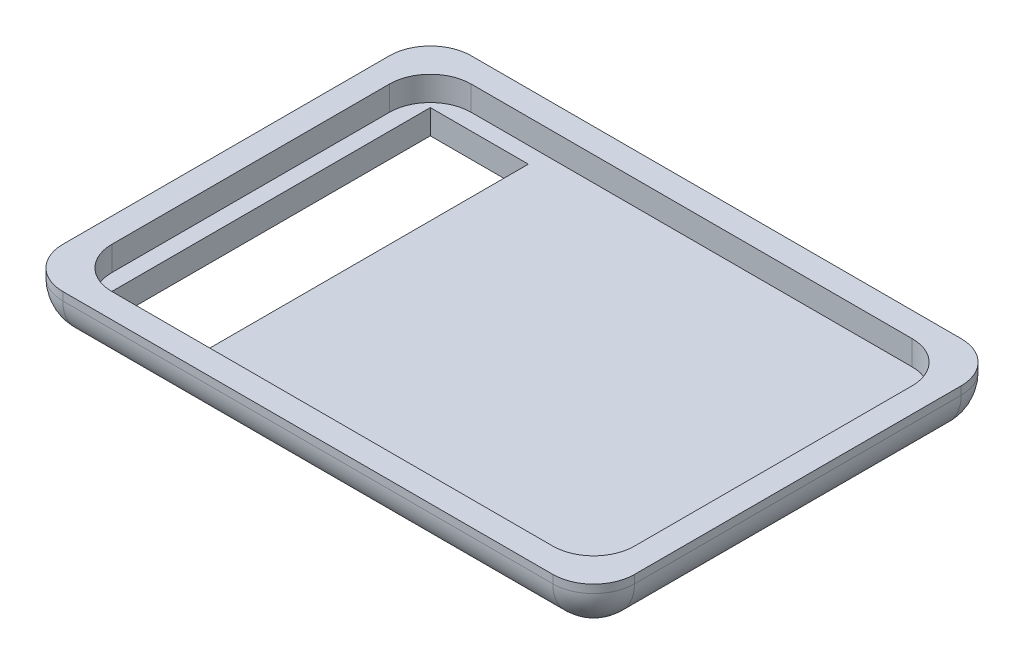
ISO-10303-21;
HEADER;
FILE_DESCRIPTION(('STEP AP214'),'2;1');
FILE_NAME('part.step','',(''),(''),'','','');
FILE_SCHEMA(('AUTOMOTIVE_DESIGN { 1 0 10303 214 1 1 1 1 }'));
ENDSEC;
DATA;
#1=APPLICATION_CONTEXT('core data for automotive mechanical design processes');
#2=APPLICATION_PROTOCOL_DEFINITION('international standard','automotive_design',2000,#1);
#3=PRODUCT_CONTEXT('',#1,'mechanical');
#4=PRODUCT('Part','Part','',(#3));
#5=PRODUCT_RELATED_PRODUCT_CATEGORY('part','',(#4));
#6=PRODUCT_DEFINITION_FORMATION('','',#4);
#7=PRODUCT_DEFINITION_CONTEXT('part definition',#1,'design');
#8=PRODUCT_DEFINITION('design','',#6,#7);
#9=PRODUCT_DEFINITION_SHAPE('','',#8);
#10=(LENGTH_UNIT() NAMED_UNIT(*) SI_UNIT(.MILLI.,.METRE.));
#11=(NAMED_UNIT(*) PLANE_ANGLE_UNIT() SI_UNIT($,.RADIAN.));
#12=(NAMED_UNIT(*) SI_UNIT($,.STERADIAN.) SOLID_ANGLE_UNIT());
#13=UNCERTAINTY_MEASURE_WITH_UNIT(LENGTH_MEASURE(1.E-05),#10,'distance_accuracy_value','');
#14=(GEOMETRIC_REPRESENTATION_CONTEXT(3) GLOBAL_UNCERTAINTY_ASSIGNED_CONTEXT((#13)) GLOBAL_UNIT_ASSIGNED_CONTEXT((#10,
#11,#12)) REPRESENTATION_CONTEXT('',''));
#15=CARTESIAN_POINT('',(0.,0.,0.));
#16=DIRECTION('',(0.,0.,1.));
#17=DIRECTION('',(1.,0.,0.));
#18=AXIS2_PLACEMENT_3D('',#15,#16,#17);
#19=CARTESIAN_POINT('',(0.,0.,0.));
#20=DIRECTION('',(0.,1.,0.));
#21=DIRECTION('',(0.,0.,1.));
#22=AXIS2_PLACEMENT_3D('',#19,#20,#21);
#23=PLANE('',#22);
#24=DIRECTION('',(0.,0.,1.));
#25=VECTOR('',#24,1.);
#26=CARTESIAN_POINT('',(-18.,0.,0.));
#27=LINE('',#26,#25);
#28=CARTESIAN_POINT('',(-18.,0.,-20.));
#29=VERTEX_POINT('',#28);
#30=CARTESIAN_POINT('',(-18.,0.,20.));
#31=VERTEX_POINT('',#30);
#32=EDGE_CURVE('E415',#29,#31,#27,.T.);
#33=ORIENTED_EDGE('',*,*,#32,.F.);
#34=DIRECTION('',(1.,0.,0.));
#35=VECTOR('',#34,1.);
#36=CARTESIAN_POINT('',(0.,0.,-20.));
#37=LINE('',#36,#35);
#38=CARTESIAN_POINT('',(30.,0.,-20.));
#39=VERTEX_POINT('',#38);
#40=EDGE_CURVE('E332',#29,#39,#37,.T.);
#41=ORIENTED_EDGE('',*,*,#40,.T.);
#42=DIRECTION('',(0.,0.,1.));
#43=VECTOR('',#42,1.);
#44=CARTESIAN_POINT('',(30.,0.,0.));
#45=LINE('',#44,#43);
#46=CARTESIAN_POINT('',(30.,0.,20.));
#47=VERTEX_POINT('',#46);
#48=EDGE_CURVE('E319',#39,#47,#45,.T.);
#49=ORIENTED_EDGE('',*,*,#48,.T.);
#50=DIRECTION('',(-1.,0.,0.));
#51=VECTOR('',#50,1.);
#52=CARTESIAN_POINT('',(0.,0.,20.));
#53=LINE('',#52,#51);
#54=EDGE_CURVE('E323',#47,#31,#53,.T.);
#55=ORIENTED_EDGE('',*,*,#54,.T.);
#56=EDGE_LOOP('',(#33,#41,#49,#55));
#57=FACE_BOUND('',#56,.T.);
#58=ADVANCED_FACE('F39',(#57),#23,.F.);
#59=CARTESIAN_POINT('',(0.,3.,0.));
#60=DIRECTION('',(0.,1.,0.));
#61=DIRECTION('',(0.,0.,1.));
#62=AXIS2_PLACEMENT_3D('',#59,#60,#61);
#63=PLANE('',#62);
#64=DIRECTION('',(0.,0.,-1.));
#65=VECTOR('',#64,1.);
#66=CARTESIAN_POINT('',(32.,3.,-25.));
#67=LINE('',#66,#65);
#68=CARTESIAN_POINT('',(32.,3.,17.));
#69=VERTEX_POINT('',#68);
#70=CARTESIAN_POINT('',(32.,3.,-17.));
#71=VERTEX_POINT('',#70);
#72=EDGE_CURVE('E411',#69,#71,#67,.T.);
#73=ORIENTED_EDGE('',*,*,#72,.T.);
#74=CARTESIAN_POINT('',(27.,3.,-17.));
#75=DIRECTION('',(0.,1.,0.));
#76=DIRECTION('',(0.,0.,1.));
#77=AXIS2_PLACEMENT_3D('',#74,#75,#76);
#78=CIRCLE('',#77,5.);
#79=CARTESIAN_POINT('',(27.,3.,-22.));
#80=VERTEX_POINT('',#79);
#81=EDGE_CURVE('E210',#71,#80,#78,.T.);
#82=ORIENTED_EDGE('',*,*,#81,.T.);
#83=DIRECTION('',(-1.,0.,0.));
#84=VECTOR('',#83,1.);
#85=CARTESIAN_POINT('',(-35.,3.,-22.));
#86=LINE('',#85,#84);
#87=CARTESIAN_POINT('',(-27.,3.,-22.));
#88=VERTEX_POINT('',#87);
#89=EDGE_CURVE('E408',#80,#88,#86,.T.);
#90=ORIENTED_EDGE('',*,*,#89,.T.);
#91=CARTESIAN_POINT('',(-27.,3.,-17.));
#92=DIRECTION('',(0.,1.,0.));
#93=DIRECTION('',(0.,0.,1.));
#94=AXIS2_PLACEMENT_3D('',#91,#92,#93);
#95=CIRCLE('',#94,5.);
#96=CARTESIAN_POINT('',(-32.,3.,-17.));
#97=VERTEX_POINT('',#96);
#98=EDGE_CURVE('E224',#88,#97,#95,.T.);
#99=ORIENTED_EDGE('',*,*,#98,.T.);
#100=DIRECTION('',(0.,0.,1.));
#101=VECTOR('',#100,1.);
#102=CARTESIAN_POINT('',(-32.,3.,-25.));
#103=LINE('',#102,#101);
#104=CARTESIAN_POINT('',(-32.,3.,17.));
#105=VERTEX_POINT('',#104);
#106=EDGE_CURVE('E405',#97,#105,#103,.T.);
#107=ORIENTED_EDGE('',*,*,#106,.T.);
#108=CARTESIAN_POINT('',(-27.,3.,17.));
#109=DIRECTION('',(0.,1.,0.));
#110=DIRECTION('',(0.,0.,1.));
#111=AXIS2_PLACEMENT_3D('',#108,#109,#110);
#112=CIRCLE('',#111,5.);
#113=CARTESIAN_POINT('',(-27.,3.,22.));
#114=VERTEX_POINT('',#113);
#115=EDGE_CURVE('E238',#105,#114,#112,.T.);
#116=ORIENTED_EDGE('',*,*,#115,.T.);
#117=DIRECTION('',(1.,0.,0.));
#118=VECTOR('',#117,1.);
#119=CARTESIAN_POINT('',(-35.,3.,22.));
#120=LINE('',#119,#118);
#121=CARTESIAN_POINT('',(27.,3.,22.));
#122=VERTEX_POINT('',#121);
#123=EDGE_CURVE('E402',#114,#122,#120,.T.);
#124=ORIENTED_EDGE('',*,*,#123,.T.);
#125=CARTESIAN_POINT('',(27.,3.,17.));
#126=DIRECTION('',(0.,1.,0.));
#127=DIRECTION('',(0.,0.,1.));
#128=AXIS2_PLACEMENT_3D('',#125,#126,#127);
#129=CIRCLE('',#128,5.);
#130=EDGE_CURVE('E252',#122,#69,#129,.T.);
#131=ORIENTED_EDGE('',*,*,#130,.T.);
#132=EDGE_LOOP('',(#73,#82,#90,#99,#107,#116,#124,#131));
#133=FACE_BOUND('',#132,.T.);
#134=DIRECTION('',(1.,0.,0.));
#135=VECTOR('',#134,1.);
#136=CARTESIAN_POINT('',(0.,3.,-20.));
#137=LINE('',#136,#135);
#138=CARTESIAN_POINT('',(-30.,3.,-20.));
#139=VERTEX_POINT('',#138);
#140=CARTESIAN_POINT('',(-18.,3.,-20.));
#141=VERTEX_POINT('',#140);
#142=EDGE_CURVE('E182',#139,#141,#137,.T.);
#143=ORIENTED_EDGE('',*,*,#142,.T.);
#144=DIRECTION('',(0.,0.,1.));
#145=VECTOR('',#144,1.);
#146=CARTESIAN_POINT('',(-18.,3.,0.));
#147=LINE('',#146,#145);
#148=CARTESIAN_POINT('',(-18.,3.,20.));
#149=VERTEX_POINT('',#148);
#150=EDGE_CURVE('E11',#141,#149,#147,.T.);
#151=ORIENTED_EDGE('',*,*,#150,.T.);
#152=DIRECTION('',(-1.,0.,0.));
#153=VECTOR('',#152,1.);
#154=CARTESIAN_POINT('',(0.,3.,20.));
#155=LINE('',#154,#153);
#156=CARTESIAN_POINT('',(-30.,3.,20.));
#157=VERTEX_POINT('',#156);
#158=EDGE_CURVE('E48',#149,#157,#155,.T.);
#159=ORIENTED_EDGE('',*,*,#158,.T.);
#160=DIRECTION('',(0.,0.,-1.));
#161=VECTOR('',#160,1.);
#162=CARTESIAN_POINT('',(-30.,3.,0.));
#163=LINE('',#162,#161);
#164=EDGE_CURVE('E190',#157,#139,#163,.T.);
#165=ORIENTED_EDGE('',*,*,#164,.T.);
#166=EDGE_LOOP('',(#143,#151,#159,#165));
#167=FACE_BOUND('',#166,.T.);
#168=ADVANCED_FACE('F203',(#133,#167),#63,.T.);
#169=CARTESIAN_POINT('',(27.,5.99999999999999,-17.));
#170=DIRECTION('',(0.,-1.,0.));
#171=DIRECTION('',(0.,0.,-1.));
#172=AXIS2_PLACEMENT_3D('',#169,#170,#171);
#173=CYLINDRICAL_SURFACE('',#172,5.);
#174=DIRECTION('',(0.,1.,0.));
#175=VECTOR('',#174,1.);
#176=CARTESIAN_POINT('',(27.,5.99999999999999,-22.));
#177=LINE('',#176,#175);
#178=CARTESIAN_POINT('',(27.,5.99999999999999,-22.));
#179=VERTEX_POINT('',#178);
#180=EDGE_CURVE('E217',#80,#179,#177,.T.);
#181=ORIENTED_EDGE('',*,*,#180,.F.);
#182=ORIENTED_EDGE('',*,*,#81,.F.);
#183=DIRECTION('',(0.,1.,0.));
#184=VECTOR('',#183,1.);
#185=CARTESIAN_POINT('',(32.,5.99999999999999,-17.));
#186=LINE('',#185,#184);
#187=CARTESIAN_POINT('',(32.,5.99999999999999,-17.));
#188=VERTEX_POINT('',#187);
#189=EDGE_CURVE('E213',#188,#71,#186,.F.);
#190=ORIENTED_EDGE('',*,*,#189,.F.);
#191=CARTESIAN_POINT('',(27.,5.99999999999999,-17.));
#192=DIRECTION('',(0.,1.,0.));
#193=DIRECTION('',(0.,0.,1.));
#194=AXIS2_PLACEMENT_3D('',#191,#192,#193);
#195=CIRCLE('',#194,5.);
#196=EDGE_CURVE('E63',#188,#179,#195,.T.);
#197=ORIENTED_EDGE('',*,*,#196,.T.);
#198=EDGE_LOOP('',(#181,#182,#190,#197));
#199=FACE_BOUND('',#198,.T.);
#200=ADVANCED_FACE('F41',(#199),#173,.F.);
#201=CARTESIAN_POINT('',(-27.,5.99999999999999,-17.));
#202=DIRECTION('',(0.,-1.,0.));
#203=DIRECTION('',(0.,0.,-1.));
#204=AXIS2_PLACEMENT_3D('',#201,#202,#203);
#205=CYLINDRICAL_SURFACE('',#204,5.);
#206=DIRECTION('',(0.,1.,0.));
#207=VECTOR('',#206,1.);
#208=CARTESIAN_POINT('',(-32.,5.99999999999999,-17.));
#209=LINE('',#208,#207);
#210=CARTESIAN_POINT('',(-32.,5.99999999999999,-17.));
#211=VERTEX_POINT('',#210);
#212=EDGE_CURVE('E231',#97,#211,#209,.T.);
#213=ORIENTED_EDGE('',*,*,#212,.F.);
#214=ORIENTED_EDGE('',*,*,#98,.F.);
#215=DIRECTION('',(0.,1.,0.));
#216=VECTOR('',#215,1.);
#217=CARTESIAN_POINT('',(-27.,5.99999999999999,-22.));
#218=LINE('',#217,#216);
#219=CARTESIAN_POINT('',(-27.,5.99999999999999,-22.));
#220=VERTEX_POINT('',#219);
#221=EDGE_CURVE('E227',#220,#88,#218,.F.);
#222=ORIENTED_EDGE('',*,*,#221,.F.);
#223=CARTESIAN_POINT('',(-27.,5.99999999999999,-17.));
#224=DIRECTION('',(0.,1.,0.));
#225=DIRECTION('',(0.,0.,1.));
#226=AXIS2_PLACEMENT_3D('',#223,#224,#225);
#227=CIRCLE('',#226,5.);
#228=EDGE_CURVE('E221',#220,#211,#227,.T.);
#229=ORIENTED_EDGE('',*,*,#228,.T.);
#230=EDGE_LOOP('',(#213,#214,#222,#229));
#231=FACE_BOUND('',#230,.T.);
#232=ADVANCED_FACE('F562',(#231),#205,.F.);
#233=CARTESIAN_POINT('',(-27.,5.99999999999999,17.));
#234=DIRECTION('',(0.,-1.,0.));
#235=DIRECTION('',(0.,0.,-1.));
#236=AXIS2_PLACEMENT_3D('',#233,#234,#235);
#237=CYLINDRICAL_SURFACE('',#236,5.);
#238=DIRECTION('',(0.,1.,0.));
#239=VECTOR('',#238,1.);
#240=CARTESIAN_POINT('',(-27.,5.99999999999999,22.));
#241=LINE('',#240,#239);
#242=CARTESIAN_POINT('',(-27.,5.99999999999999,22.));
#243=VERTEX_POINT('',#242);
#244=EDGE_CURVE('E245',#114,#243,#241,.T.);
#245=ORIENTED_EDGE('',*,*,#244,.F.);
#246=ORIENTED_EDGE('',*,*,#115,.F.);
#247=DIRECTION('',(0.,1.,0.));
#248=VECTOR('',#247,1.);
#249=CARTESIAN_POINT('',(-32.,5.99999999999999,17.));
#250=LINE('',#249,#248);
#251=CARTESIAN_POINT('',(-32.,5.99999999999999,17.));
#252=VERTEX_POINT('',#251);
#253=EDGE_CURVE('E241',#252,#105,#250,.F.);
#254=ORIENTED_EDGE('',*,*,#253,.F.);
#255=CARTESIAN_POINT('',(-27.,5.99999999999999,17.));
#256=DIRECTION('',(0.,1.,0.));
#257=DIRECTION('',(0.,0.,1.));
#258=AXIS2_PLACEMENT_3D('',#255,#256,#257);
#259=CIRCLE('',#258,5.);
#260=EDGE_CURVE('E235',#252,#243,#259,.T.);
#261=ORIENTED_EDGE('',*,*,#260,.T.);
#262=EDGE_LOOP('',(#245,#246,#254,#261));
#263=FACE_BOUND('',#262,.T.);
#264=ADVANCED_FACE('F559',(#263),#237,.F.);
#265=CARTESIAN_POINT('',(27.,5.99999999999999,17.));
#266=DIRECTION('',(0.,1.,0.));
#267=DIRECTION('',(0.,0.,1.));
#268=AXIS2_PLACEMENT_3D('',#265,#266,#267);
#269=CYLINDRICAL_SURFACE('',#268,5.);
#270=DIRECTION('',(0.,-1.,0.));
#271=VECTOR('',#270,1.);
#272=CARTESIAN_POINT('',(27.,5.99999999999999,22.));
#273=LINE('',#272,#271);
#274=CARTESIAN_POINT('',(27.,5.99999999999999,22.));
#275=VERTEX_POINT('',#274);
#276=EDGE_CURVE('E259',#275,#122,#273,.T.);
#277=ORIENTED_EDGE('',*,*,#276,.F.);
#278=CARTESIAN_POINT('',(27.,5.99999999999999,17.));
#279=DIRECTION('',(0.,1.,0.));
#280=DIRECTION('',(0.,0.,1.));
#281=AXIS2_PLACEMENT_3D('',#278,#279,#280);
#282=CIRCLE('',#281,5.);
#283=CARTESIAN_POINT('',(32.,5.99999999999999,17.));
#284=VERTEX_POINT('',#283);
#285=EDGE_CURVE('E249',#275,#284,#282,.T.);
#286=ORIENTED_EDGE('',*,*,#285,.T.);
#287=DIRECTION('',(0.,-1.,0.));
#288=VECTOR('',#287,1.);
#289=CARTESIAN_POINT('',(32.,5.99999999999999,17.));
#290=LINE('',#289,#288);
#291=EDGE_CURVE('E255',#69,#284,#290,.F.);
#292=ORIENTED_EDGE('',*,*,#291,.F.);
#293=ORIENTED_EDGE('',*,*,#130,.F.);
#294=EDGE_LOOP('',(#277,#286,#292,#293));
#295=FACE_BOUND('',#294,.T.);
#296=ADVANCED_FACE('F556',(#295),#269,.F.);
#297=CARTESIAN_POINT('',(30.,5.,-20.));
#298=DIRECTION('',(0.,1.,0.));
#299=DIRECTION('',(0.,0.,1.));
#300=AXIS2_PLACEMENT_3D('',#297,#298,#299);
#301=SPHERICAL_SURFACE('',#300,5.);
#302=CARTESIAN_POINT('',(30.,5.,-20.));
#303=DIRECTION('',(0.,0.,1.));
#304=DIRECTION('',(1.,0.,0.));
#305=AXIS2_PLACEMENT_3D('',#302,#303,#304);
#306=CIRCLE('',#305,5.);
#307=CARTESIAN_POINT('',(35.,5.,-20.));
#308=VERTEX_POINT('',#307);
#309=EDGE_CURVE('E263',#39,#308,#306,.T.);
#310=ORIENTED_EDGE('',*,*,#309,.F.);
#311=CARTESIAN_POINT('',(30.,5.,-20.));
#312=DIRECTION('',(1.,0.,0.));
#313=DIRECTION('',(0.,0.,-1.));
#314=AXIS2_PLACEMENT_3D('',#311,#312,#313);
#315=CIRCLE('',#314,5.);
#316=CARTESIAN_POINT('',(30.,5.,-25.));
#317=VERTEX_POINT('',#316);
#318=EDGE_CURVE('E266',#39,#317,#315,.T.);
#319=ORIENTED_EDGE('',*,*,#318,.T.);
#320=CARTESIAN_POINT('',(30.,5.,-20.));
#321=DIRECTION('',(0.,1.,0.));
#322=DIRECTION('',(0.,0.,1.));
#323=AXIS2_PLACEMENT_3D('',#320,#321,#322);
#324=CIRCLE('',#323,5.);
#325=EDGE_CURVE('E287',#308,#317,#324,.T.);
#326=ORIENTED_EDGE('',*,*,#325,.F.);
#327=EDGE_LOOP('',(#310,#319,#326));
#328=FACE_BOUND('',#327,.T.);
#329=ADVANCED_FACE('F440',(#328),#301,.T.);
#330=CARTESIAN_POINT('',(0.,5.,-20.));
#331=DIRECTION('',(1.,0.,0.));
#332=DIRECTION('',(0.,0.,-1.));
#333=AXIS2_PLACEMENT_3D('',#330,#331,#332);
#334=CYLINDRICAL_SURFACE('',#333,5.);
#335=ORIENTED_EDGE('',*,*,#318,.F.);
#336=ORIENTED_EDGE('',*,*,#40,.F.);
#337=CARTESIAN_POINT('',(-30.,0.,-20.));
#338=VERTEX_POINT('',#337);
#339=EDGE_CURVE('E329',#338,#29,#37,.T.);
#340=ORIENTED_EDGE('',*,*,#339,.F.);
#341=CARTESIAN_POINT('',(-30.,5.,-20.));
#342=DIRECTION('',(1.,0.,0.));
#343=DIRECTION('',(0.,0.,-1.));
#344=AXIS2_PLACEMENT_3D('',#341,#342,#343);
#345=CIRCLE('',#344,5.);
#346=CARTESIAN_POINT('',(-30.,5.,-25.));
#347=VERTEX_POINT('',#346);
#348=EDGE_CURVE('E269',#338,#347,#345,.T.);
#349=ORIENTED_EDGE('',*,*,#348,.T.);
#350=DIRECTION('',(1.,0.,0.));
#351=VECTOR('',#350,1.);
#352=CARTESIAN_POINT('',(-35.,5.,-25.));
#353=LINE('',#352,#351);
#354=EDGE_CURVE('E291',#317,#347,#353,.F.);
#355=ORIENTED_EDGE('',*,*,#354,.F.);
#356=EDGE_LOOP('',(#335,#336,#340,#349,#355));
#357=FACE_BOUND('',#356,.T.);
#358=ADVANCED_FACE('F444',(#357),#334,.T.);
#359=CARTESIAN_POINT('',(-30.,5.,-20.));
#360=DIRECTION('',(0.,1.,0.));
#361=DIRECTION('',(0.,0.,1.));
#362=AXIS2_PLACEMENT_3D('',#359,#360,#361);
#363=SPHERICAL_SURFACE('',#362,5.);
#364=ORIENTED_EDGE('',*,*,#348,.F.);
#365=CARTESIAN_POINT('',(-30.,5.,-20.));
#366=DIRECTION('',(0.,0.,-1.));
#367=DIRECTION('',(-1.,0.,0.));
#368=AXIS2_PLACEMENT_3D('',#365,#366,#367);
#369=CIRCLE('',#368,5.);
#370=CARTESIAN_POINT('',(-35.,5.,-20.));
#371=VERTEX_POINT('',#370);
#372=EDGE_CURVE('E272',#338,#371,#369,.T.);
#373=ORIENTED_EDGE('',*,*,#372,.T.);
#374=CARTESIAN_POINT('',(-30.,5.,-20.));
#375=DIRECTION('',(0.,-1.,0.));
#376=DIRECTION('',(0.,0.,-1.));
#377=AXIS2_PLACEMENT_3D('',#374,#375,#376);
#378=CIRCLE('',#377,5.);
#379=EDGE_CURVE('E295',#347,#371,#378,.F.);
#380=ORIENTED_EDGE('',*,*,#379,.F.);
#381=EDGE_LOOP('',(#364,#373,#380));
#382=FACE_BOUND('',#381,.T.);
#383=ADVANCED_FACE('F492',(#382),#363,.T.);
#384=CARTESIAN_POINT('',(-30.,5.,0.));
#385=DIRECTION('',(0.,0.,-1.));
#386=DIRECTION('',(-1.,0.,0.));
#387=AXIS2_PLACEMENT_3D('',#384,#385,#386);
#388=CYLINDRICAL_SURFACE('',#387,5.);
#389=ORIENTED_EDGE('',*,*,#372,.F.);
#390=DIRECTION('',(0.,0.,-1.));
#391=VECTOR('',#390,1.);
#392=CARTESIAN_POINT('',(-30.,0.,0.));
#393=LINE('',#392,#391);
#394=CARTESIAN_POINT('',(-30.,0.,20.));
#395=VERTEX_POINT('',#394);
#396=EDGE_CURVE('E197',#395,#338,#393,.T.);
#397=ORIENTED_EDGE('',*,*,#396,.F.);
#398=CARTESIAN_POINT('',(-30.,5.,20.));
#399=DIRECTION('',(0.,0.,-1.));
#400=DIRECTION('',(-1.,0.,0.));
#401=AXIS2_PLACEMENT_3D('',#398,#399,#400);
#402=CIRCLE('',#401,5.);
#403=CARTESIAN_POINT('',(-35.,5.,20.));
#404=VERTEX_POINT('',#403);
#405=EDGE_CURVE('E275',#395,#404,#402,.T.);
#406=ORIENTED_EDGE('',*,*,#405,.T.);
#407=DIRECTION('',(0.,0.,-1.));
#408=VECTOR('',#407,1.);
#409=CARTESIAN_POINT('',(-35.,5.,-25.));
#410=LINE('',#409,#408);
#411=EDGE_CURVE('E299',#371,#404,#410,.F.);
#412=ORIENTED_EDGE('',*,*,#411,.F.);
#413=EDGE_LOOP('',(#389,#397,#406,#412));
#414=FACE_BOUND('',#413,.T.);
#415=ADVANCED_FACE('F482',(#414),#388,.T.);
#416=CARTESIAN_POINT('',(-30.,5.,20.));
#417=DIRECTION('',(0.,1.,0.));
#418=DIRECTION('',(0.,0.,1.));
#419=AXIS2_PLACEMENT_3D('',#416,#417,#418);
#420=SPHERICAL_SURFACE('',#419,5.);
#421=ORIENTED_EDGE('',*,*,#405,.F.);
#422=CARTESIAN_POINT('',(-30.,5.,20.));
#423=DIRECTION('',(-1.,0.,0.));
#424=DIRECTION('',(0.,0.,1.));
#425=AXIS2_PLACEMENT_3D('',#422,#423,#424);
#426=CIRCLE('',#425,5.);
#427=CARTESIAN_POINT('',(-30.,5.,25.));
#428=VERTEX_POINT('',#427);
#429=EDGE_CURVE('E278',#395,#428,#426,.T.);
#430=ORIENTED_EDGE('',*,*,#429,.T.);
#431=CARTESIAN_POINT('',(-30.,5.,20.));
#432=DIRECTION('',(0.,-1.,0.));
#433=DIRECTION('',(0.,0.,-1.));
#434=AXIS2_PLACEMENT_3D('',#431,#432,#433);
#435=CIRCLE('',#434,5.);
#436=EDGE_CURVE('E303',#404,#428,#435,.F.);
#437=ORIENTED_EDGE('',*,*,#436,.F.);
#438=EDGE_LOOP('',(#421,#430,#437));
#439=FACE_BOUND('',#438,.T.);
#440=ADVANCED_FACE('F478',(#439),#420,.T.);
#441=CARTESIAN_POINT('',(0.,5.,20.));
#442=DIRECTION('',(-1.,0.,0.));
#443=DIRECTION('',(0.,0.,1.));
#444=AXIS2_PLACEMENT_3D('',#441,#442,#443);
#445=CYLINDRICAL_SURFACE('',#444,5.);
#446=ORIENTED_EDGE('',*,*,#429,.F.);
#447=DIRECTION('',(-1.,0.,0.));
#448=VECTOR('',#447,1.);
#449=CARTESIAN_POINT('',(0.,0.,20.));
#450=LINE('',#449,#448);
#451=EDGE_CURVE('E418',#31,#395,#450,.T.);
#452=ORIENTED_EDGE('',*,*,#451,.F.);
#453=ORIENTED_EDGE('',*,*,#54,.F.);
#454=CARTESIAN_POINT('',(30.,5.,20.));
#455=DIRECTION('',(-1.,0.,0.));
#456=DIRECTION('',(0.,0.,1.));
#457=AXIS2_PLACEMENT_3D('',#454,#455,#456);
#458=CIRCLE('',#457,5.);
#459=CARTESIAN_POINT('',(30.,5.,25.));
#460=VERTEX_POINT('',#459);
#461=EDGE_CURVE('E281',#47,#460,#458,.T.);
#462=ORIENTED_EDGE('',*,*,#461,.T.);
#463=DIRECTION('',(-1.,0.,0.));
#464=VECTOR('',#463,1.);
#465=CARTESIAN_POINT('',(-35.,5.,25.));
#466=LINE('',#465,#464);
#467=EDGE_CURVE('E307',#428,#460,#466,.F.);
#468=ORIENTED_EDGE('',*,*,#467,.F.);
#469=EDGE_LOOP('',(#446,#452,#453,#462,#468));
#470=FACE_BOUND('',#469,.T.);
#471=ADVANCED_FACE('F473',(#470),#445,.T.);
#472=CARTESIAN_POINT('',(30.,5.,20.));
#473=DIRECTION('',(0.,1.,0.));
#474=DIRECTION('',(0.,0.,1.));
#475=AXIS2_PLACEMENT_3D('',#472,#473,#474);
#476=SPHERICAL_SURFACE('',#475,5.);
#477=ORIENTED_EDGE('',*,*,#461,.F.);
#478=CARTESIAN_POINT('',(30.,5.,20.));
#479=DIRECTION('',(0.,0.,1.));
#480=DIRECTION('',(1.,0.,0.));
#481=AXIS2_PLACEMENT_3D('',#478,#479,#480);
#482=CIRCLE('',#481,5.);
#483=CARTESIAN_POINT('',(35.,5.,20.));
#484=VERTEX_POINT('',#483);
#485=EDGE_CURVE('E284',#47,#484,#482,.T.);
#486=ORIENTED_EDGE('',*,*,#485,.T.);
#487=CARTESIAN_POINT('',(30.,5.,20.));
#488=DIRECTION('',(0.,1.,0.));
#489=DIRECTION('',(0.,0.,1.));
#490=AXIS2_PLACEMENT_3D('',#487,#488,#489);
#491=CIRCLE('',#490,5.);
#492=EDGE_CURVE('E311',#460,#484,#491,.T.);
#493=ORIENTED_EDGE('',*,*,#492,.F.);
#494=EDGE_LOOP('',(#477,#486,#493));
#495=FACE_BOUND('',#494,.T.);
#496=ADVANCED_FACE('F449',(#495),#476,.T.);
#497=CARTESIAN_POINT('',(30.,5.,0.));
#498=DIRECTION('',(0.,0.,1.));
#499=DIRECTION('',(1.,0.,0.));
#500=AXIS2_PLACEMENT_3D('',#497,#498,#499);
#501=CYLINDRICAL_SURFACE('',#500,5.);
#502=ORIENTED_EDGE('',*,*,#48,.F.);
#503=ORIENTED_EDGE('',*,*,#309,.T.);
#504=DIRECTION('',(0.,0.,1.));
#505=VECTOR('',#504,1.);
#506=CARTESIAN_POINT('',(35.,5.,-25.));
#507=LINE('',#506,#505);
#508=EDGE_CURVE('E315',#484,#308,#507,.F.);
#509=ORIENTED_EDGE('',*,*,#508,.F.);
#510=ORIENTED_EDGE('',*,*,#485,.F.);
#511=EDGE_LOOP('',(#502,#503,#509,#510));
#512=FACE_BOUND('',#511,.T.);
#513=ADVANCED_FACE('F446',(#512),#501,.T.);
#514=CARTESIAN_POINT('',(-30.,5.99999999999999,-20.));
#515=DIRECTION('',(0.,-1.,0.));
#516=DIRECTION('',(0.,0.,-1.));
#517=AXIS2_PLACEMENT_3D('',#514,#515,#516);
#518=CYLINDRICAL_SURFACE('',#517,5.);
#519=DIRECTION('',(0.,-1.,0.));
#520=VECTOR('',#519,1.);
#521=CARTESIAN_POINT('',(-30.,5.99999999999999,-25.));
#522=LINE('',#521,#520);
#523=CARTESIAN_POINT('',(-30.,5.99999999999999,-25.));
#524=VERTEX_POINT('',#523);
#525=EDGE_CURVE('E336',#347,#524,#522,.F.);
#526=ORIENTED_EDGE('',*,*,#525,.F.);
#527=ORIENTED_EDGE('',*,*,#379,.T.);
#528=DIRECTION('',(0.,-1.,0.));
#529=VECTOR('',#528,1.);
#530=CARTESIAN_POINT('',(-35.,5.99999999999999,-20.));
#531=LINE('',#530,#529);
#532=CARTESIAN_POINT('',(-35.,5.99999999999999,-20.));
#533=VERTEX_POINT('',#532);
#534=EDGE_CURVE('E339',#533,#371,#531,.T.);
#535=ORIENTED_EDGE('',*,*,#534,.F.);
#536=CARTESIAN_POINT('',(-30.,5.99999999999999,-20.));
#537=DIRECTION('',(0.,1.,0.));
#538=DIRECTION('',(0.,0.,1.));
#539=AXIS2_PLACEMENT_3D('',#536,#537,#538);
#540=CIRCLE('',#539,5.);
#541=EDGE_CURVE('E333',#524,#533,#540,.T.);
#542=ORIENTED_EDGE('',*,*,#541,.F.);
#543=EDGE_LOOP('',(#526,#527,#535,#542));
#544=FACE_BOUND('',#543,.T.);
#545=ADVANCED_FACE('F489',(#544),#518,.T.);
#546=CARTESIAN_POINT('',(-30.,5.99999999999999,20.));
#547=DIRECTION('',(0.,-1.,0.));
#548=DIRECTION('',(0.,0.,-1.));
#549=AXIS2_PLACEMENT_3D('',#546,#547,#548);
#550=CYLINDRICAL_SURFACE('',#549,5.);
#551=DIRECTION('',(0.,-1.,0.));
#552=VECTOR('',#551,1.);
#553=CARTESIAN_POINT('',(-35.,5.99999999999999,20.));
#554=LINE('',#553,#552);
#555=CARTESIAN_POINT('',(-35.,5.99999999999999,20.));
#556=VERTEX_POINT('',#555);
#557=EDGE_CURVE('E346',#404,#556,#554,.F.);
#558=ORIENTED_EDGE('',*,*,#557,.F.);
#559=ORIENTED_EDGE('',*,*,#436,.T.);
#560=DIRECTION('',(0.,-1.,0.));
#561=VECTOR('',#560,1.);
#562=CARTESIAN_POINT('',(-30.,5.99999999999999,25.));
#563=LINE('',#562,#561);
#564=CARTESIAN_POINT('',(-30.,5.99999999999999,25.));
#565=VERTEX_POINT('',#564);
#566=EDGE_CURVE('E349',#565,#428,#563,.T.);
#567=ORIENTED_EDGE('',*,*,#566,.F.);
#568=CARTESIAN_POINT('',(-30.,5.99999999999999,20.));
#569=DIRECTION('',(0.,1.,0.));
#570=DIRECTION('',(0.,0.,1.));
#571=AXIS2_PLACEMENT_3D('',#568,#569,#570);
#572=CIRCLE('',#571,5.);
#573=EDGE_CURVE('E343',#556,#565,#572,.T.);
#574=ORIENTED_EDGE('',*,*,#573,.F.);
#575=EDGE_LOOP('',(#558,#559,#567,#574));
#576=FACE_BOUND('',#575,.T.);
#577=ADVANCED_FACE('F467',(#576),#550,.T.);
#578=CARTESIAN_POINT('',(30.,5.99999999999999,-20.));
#579=DIRECTION('',(0.,1.,0.));
#580=DIRECTION('',(0.,0.,1.));
#581=AXIS2_PLACEMENT_3D('',#578,#579,#580);
#582=CYLINDRICAL_SURFACE('',#581,5.);
#583=DIRECTION('',(0.,1.,0.));
#584=VECTOR('',#583,1.);
#585=CARTESIAN_POINT('',(35.,5.99999999999999,-20.));
#586=LINE('',#585,#584);
#587=CARTESIAN_POINT('',(35.,5.99999999999999,-20.));
#588=VERTEX_POINT('',#587);
#589=EDGE_CURVE('E360',#308,#588,#586,.T.);
#590=ORIENTED_EDGE('',*,*,#589,.F.);
#591=ORIENTED_EDGE('',*,*,#325,.T.);
#592=DIRECTION('',(0.,1.,0.));
#593=VECTOR('',#592,1.);
#594=CARTESIAN_POINT('',(30.,5.99999999999999,-25.));
#595=LINE('',#594,#593);
#596=CARTESIAN_POINT('',(30.,5.99999999999999,-25.));
#597=VERTEX_POINT('',#596);
#598=EDGE_CURVE('E356',#597,#317,#595,.F.);
#599=ORIENTED_EDGE('',*,*,#598,.F.);
#600=CARTESIAN_POINT('',(30.,5.99999999999999,-20.));
#601=DIRECTION('',(0.,1.,0.));
#602=DIRECTION('',(0.,0.,1.));
#603=AXIS2_PLACEMENT_3D('',#600,#601,#602);
#604=CIRCLE('',#603,5.);
#605=EDGE_CURVE('E353',#588,#597,#604,.T.);
#606=ORIENTED_EDGE('',*,*,#605,.F.);
#607=EDGE_LOOP('',(#590,#591,#599,#606));
#608=FACE_BOUND('',#607,.T.);
#609=ADVANCED_FACE('F532',(#608),#582,.T.);
#610=CARTESIAN_POINT('',(30.,5.99999999999999,20.));
#611=DIRECTION('',(0.,1.,0.));
#612=DIRECTION('',(0.,0.,1.));
#613=AXIS2_PLACEMENT_3D('',#610,#611,#612);
#614=CYLINDRICAL_SURFACE('',#613,5.);
#615=DIRECTION('',(0.,1.,0.));
#616=VECTOR('',#615,1.);
#617=CARTESIAN_POINT('',(30.,5.99999999999999,25.));
#618=LINE('',#617,#616);
#619=CARTESIAN_POINT('',(30.,5.99999999999999,25.));
#620=VERTEX_POINT('',#619);
#621=EDGE_CURVE('E370',#460,#620,#618,.T.);
#622=ORIENTED_EDGE('',*,*,#621,.F.);
#623=ORIENTED_EDGE('',*,*,#492,.T.);
#624=DIRECTION('',(0.,1.,0.));
#625=VECTOR('',#624,1.);
#626=CARTESIAN_POINT('',(35.,5.99999999999999,20.));
#627=LINE('',#626,#625);
#628=CARTESIAN_POINT('',(35.,5.99999999999999,20.));
#629=VERTEX_POINT('',#628);
#630=EDGE_CURVE('E366',#629,#484,#627,.F.);
#631=ORIENTED_EDGE('',*,*,#630,.F.);
#632=CARTESIAN_POINT('',(30.,5.99999999999999,20.));
#633=DIRECTION('',(0.,1.,0.));
#634=DIRECTION('',(0.,0.,1.));
#635=AXIS2_PLACEMENT_3D('',#632,#633,#634);
#636=CIRCLE('',#635,5.);
#637=EDGE_CURVE('E363',#620,#629,#636,.T.);
#638=ORIENTED_EDGE('',*,*,#637,.F.);
#639=EDGE_LOOP('',(#622,#623,#631,#638));
#640=FACE_BOUND('',#639,.T.);
#641=ADVANCED_FACE('F453',(#640),#614,.T.);
#642=CARTESIAN_POINT('',(35.,5.99999999999999,-25.));
#643=DIRECTION('',(-1.,0.,0.));
#644=DIRECTION('',(0.,0.,1.));
#645=AXIS2_PLACEMENT_3D('',#642,#643,#644);
#646=PLANE('',#645);
#647=ORIENTED_EDGE('',*,*,#630,.T.);
#648=ORIENTED_EDGE('',*,*,#508,.T.);
#649=ORIENTED_EDGE('',*,*,#589,.T.);
#650=DIRECTION('',(0.,0.,-1.));
#651=VECTOR('',#650,1.);
#652=CARTESIAN_POINT('',(35.,5.99999999999999,-25.));
#653=LINE('',#652,#651);
#654=EDGE_CURVE('E385',#629,#588,#653,.T.);
#655=ORIENTED_EDGE('',*,*,#654,.F.);
#656=EDGE_LOOP('',(#647,#648,#649,#655));
#657=FACE_BOUND('',#656,.T.);
#658=ADVANCED_FACE('F525',(#657),#646,.F.);
#659=CARTESIAN_POINT('',(-35.,5.99999999999999,-25.));
#660=DIRECTION('',(0.,0.,1.));
#661=DIRECTION('',(1.,0.,0.));
#662=AXIS2_PLACEMENT_3D('',#659,#660,#661);
#663=PLANE('',#662);
#664=ORIENTED_EDGE('',*,*,#598,.T.);
#665=ORIENTED_EDGE('',*,*,#354,.T.);
#666=ORIENTED_EDGE('',*,*,#525,.T.);
#667=DIRECTION('',(-1.,0.,0.));
#668=VECTOR('',#667,1.);
#669=CARTESIAN_POINT('',(-35.,5.99999999999999,-25.));
#670=LINE('',#669,#668);
#671=EDGE_CURVE('E381',#597,#524,#670,.T.);
#672=ORIENTED_EDGE('',*,*,#671,.F.);
#673=EDGE_LOOP('',(#664,#665,#666,#672));
#674=FACE_BOUND('',#673,.T.);
#675=ADVANCED_FACE('F522',(#674),#663,.F.);
#676=CARTESIAN_POINT('',(-35.,5.99999999999999,-25.));
#677=DIRECTION('',(1.,0.,0.));
#678=DIRECTION('',(0.,0.,-1.));
#679=AXIS2_PLACEMENT_3D('',#676,#677,#678);
#680=PLANE('',#679);
#681=ORIENTED_EDGE('',*,*,#534,.T.);
#682=ORIENTED_EDGE('',*,*,#411,.T.);
#683=ORIENTED_EDGE('',*,*,#557,.T.);
#684=DIRECTION('',(0.,0.,1.));
#685=VECTOR('',#684,1.);
#686=CARTESIAN_POINT('',(-35.,5.99999999999999,-25.));
#687=LINE('',#686,#685);
#688=EDGE_CURVE('E377',#533,#556,#687,.T.);
#689=ORIENTED_EDGE('',*,*,#688,.F.);
#690=EDGE_LOOP('',(#681,#682,#683,#689));
#691=FACE_BOUND('',#690,.T.);
#692=ADVANCED_FACE('F484',(#691),#680,.F.);
#693=CARTESIAN_POINT('',(-35.,5.99999999999999,25.));
#694=DIRECTION('',(0.,0.,-1.));
#695=DIRECTION('',(-1.,0.,0.));
#696=AXIS2_PLACEMENT_3D('',#693,#694,#695);
#697=PLANE('',#696);
#698=ORIENTED_EDGE('',*,*,#566,.T.);
#699=ORIENTED_EDGE('',*,*,#467,.T.);
#700=ORIENTED_EDGE('',*,*,#621,.T.);
#701=DIRECTION('',(1.,0.,0.));
#702=VECTOR('',#701,1.);
#703=CARTESIAN_POINT('',(-35.,5.99999999999999,25.));
#704=LINE('',#703,#702);
#705=EDGE_CURVE('E373',#565,#620,#704,.T.);
#706=ORIENTED_EDGE('',*,*,#705,.F.);
#707=EDGE_LOOP('',(#698,#699,#700,#706));
#708=FACE_BOUND('',#707,.T.);
#709=ADVANCED_FACE('F458',(#708),#697,.F.);
#710=CARTESIAN_POINT('',(0.,5.99999999999999,0.));
#711=DIRECTION('',(0.,1.,0.));
#712=DIRECTION('',(0.,0.,1.));
#713=AXIS2_PLACEMENT_3D('',#710,#711,#712);
#714=PLANE('',#713);
#715=DIRECTION('',(0.,0.,-1.));
#716=VECTOR('',#715,1.);
#717=CARTESIAN_POINT('',(32.,5.99999999999999,-25.));
#718=LINE('',#717,#716);
#719=EDGE_CURVE('E398',#284,#188,#718,.T.);
#720=ORIENTED_EDGE('',*,*,#719,.F.);
#721=ORIENTED_EDGE('',*,*,#285,.F.);
#722=DIRECTION('',(1.,0.,0.));
#723=VECTOR('',#722,1.);
#724=CARTESIAN_POINT('',(-35.,5.99999999999999,22.));
#725=LINE('',#724,#723);
#726=EDGE_CURVE('E389',#243,#275,#725,.T.);
#727=ORIENTED_EDGE('',*,*,#726,.F.);
#728=ORIENTED_EDGE('',*,*,#260,.F.);
#729=DIRECTION('',(0.,0.,1.));
#730=VECTOR('',#729,1.);
#731=CARTESIAN_POINT('',(-32.,5.99999999999999,-25.));
#732=LINE('',#731,#730);
#733=EDGE_CURVE('E392',#211,#252,#732,.T.);
#734=ORIENTED_EDGE('',*,*,#733,.F.);
#735=ORIENTED_EDGE('',*,*,#228,.F.);
#736=DIRECTION('',(-1.,0.,0.));
#737=VECTOR('',#736,1.);
#738=CARTESIAN_POINT('',(-35.,5.99999999999999,-22.));
#739=LINE('',#738,#737);
#740=EDGE_CURVE('E395',#179,#220,#739,.T.);
#741=ORIENTED_EDGE('',*,*,#740,.F.);
#742=ORIENTED_EDGE('',*,*,#196,.F.);
#743=EDGE_LOOP('',(#720,#721,#727,#728,#734,#735,#741,#742));
#744=FACE_BOUND('',#743,.T.);
#745=ORIENTED_EDGE('',*,*,#671,.T.);
#746=ORIENTED_EDGE('',*,*,#541,.T.);
#747=ORIENTED_EDGE('',*,*,#688,.T.);
#748=ORIENTED_EDGE('',*,*,#573,.T.);
#749=ORIENTED_EDGE('',*,*,#705,.T.);
#750=ORIENTED_EDGE('',*,*,#637,.T.);
#751=ORIENTED_EDGE('',*,*,#654,.T.);
#752=ORIENTED_EDGE('',*,*,#605,.T.);
#753=EDGE_LOOP('',(#745,#746,#747,#748,#749,#750,#751,#752));
#754=FACE_BOUND('',#753,.T.);
#755=ADVANCED_FACE('F461',(#744,#754),#714,.T.);
#756=CARTESIAN_POINT('',(32.,5.99999999999999,-25.));
#757=DIRECTION('',(-1.,0.,0.));
#758=DIRECTION('',(0.,0.,1.));
#759=AXIS2_PLACEMENT_3D('',#756,#757,#758);
#760=PLANE('',#759);
#761=ORIENTED_EDGE('',*,*,#719,.T.);
#762=ORIENTED_EDGE('',*,*,#189,.T.);
#763=ORIENTED_EDGE('',*,*,#72,.F.);
#764=ORIENTED_EDGE('',*,*,#291,.T.);
#765=EDGE_LOOP('',(#761,#762,#763,#764));
#766=FACE_BOUND('',#765,.T.);
#767=ADVANCED_FACE('F589',(#766),#760,.T.);
#768=CARTESIAN_POINT('',(-35.,5.99999999999999,-22.));
#769=DIRECTION('',(0.,0.,1.));
#770=DIRECTION('',(1.,0.,0.));
#771=AXIS2_PLACEMENT_3D('',#768,#769,#770);
#772=PLANE('',#771);
#773=ORIENTED_EDGE('',*,*,#89,.F.);
#774=ORIENTED_EDGE('',*,*,#180,.T.);
#775=ORIENTED_EDGE('',*,*,#740,.T.);
#776=ORIENTED_EDGE('',*,*,#221,.T.);
#777=EDGE_LOOP('',(#773,#774,#775,#776));
#778=FACE_BOUND('',#777,.T.);
#779=ADVANCED_FACE('F593',(#778),#772,.T.);
#780=CARTESIAN_POINT('',(-32.,5.99999999999999,-25.));
#781=DIRECTION('',(1.,0.,0.));
#782=DIRECTION('',(0.,0.,-1.));
#783=AXIS2_PLACEMENT_3D('',#780,#781,#782);
#784=PLANE('',#783);
#785=ORIENTED_EDGE('',*,*,#106,.F.);
#786=ORIENTED_EDGE('',*,*,#212,.T.);
#787=ORIENTED_EDGE('',*,*,#733,.T.);
#788=ORIENTED_EDGE('',*,*,#253,.T.);
#789=EDGE_LOOP('',(#785,#786,#787,#788));
#790=FACE_BOUND('',#789,.T.);
#791=ADVANCED_FACE('F504',(#790),#784,.T.);
#792=CARTESIAN_POINT('',(-35.,5.99999999999999,22.));
#793=DIRECTION('',(0.,0.,-1.));
#794=DIRECTION('',(-1.,0.,0.));
#795=AXIS2_PLACEMENT_3D('',#792,#793,#794);
#796=PLANE('',#795);
#797=ORIENTED_EDGE('',*,*,#123,.F.);
#798=ORIENTED_EDGE('',*,*,#244,.T.);
#799=ORIENTED_EDGE('',*,*,#726,.T.);
#800=ORIENTED_EDGE('',*,*,#276,.T.);
#801=EDGE_LOOP('',(#797,#798,#799,#800));
#802=FACE_BOUND('',#801,.T.);
#803=ADVANCED_FACE('F496',(#802),#796,.T.);
#804=CARTESIAN_POINT('',(-18.,-10.,20.));
#805=DIRECTION('',(-1.,0.,0.));
#806=DIRECTION('',(0.,0.,1.));
#807=AXIS2_PLACEMENT_3D('',#804,#805,#806);
#808=PLANE('',#807);
#809=ORIENTED_EDGE('',*,*,#32,.T.);
#810=DIRECTION('',(0.,1.,0.));
#811=VECTOR('',#810,1.);
#812=CARTESIAN_POINT('',(-18.,-10.,20.));
#813=LINE('',#812,#811);
#814=EDGE_CURVE('E421',#31,#149,#813,.T.);
#815=ORIENTED_EDGE('',*,*,#814,.T.);
#816=ORIENTED_EDGE('',*,*,#150,.F.);
#817=DIRECTION('',(0.,1.,0.));
#818=VECTOR('',#817,1.);
#819=CARTESIAN_POINT('',(-18.,-10.,-20.));
#820=LINE('',#819,#818);
#821=EDGE_CURVE('E55',#29,#141,#820,.T.);
#822=ORIENTED_EDGE('',*,*,#821,.F.);
#823=EDGE_LOOP('',(#809,#815,#816,#822));
#824=FACE_BOUND('',#823,.T.);
#825=ADVANCED_FACE('F494',(#824),#808,.T.);
#826=CARTESIAN_POINT('',(-30.,-10.,20.));
#827=DIRECTION('',(0.,0.,-1.));
#828=DIRECTION('',(-1.,0.,0.));
#829=AXIS2_PLACEMENT_3D('',#826,#827,#828);
#830=PLANE('',#829);
#831=ORIENTED_EDGE('',*,*,#451,.T.);
#832=DIRECTION('',(0.,1.,0.));
#833=VECTOR('',#832,1.);
#834=CARTESIAN_POINT('',(-30.,-10.,20.));
#835=LINE('',#834,#833);
#836=EDGE_CURVE('E200',#395,#157,#835,.T.);
#837=ORIENTED_EDGE('',*,*,#836,.T.);
#838=ORIENTED_EDGE('',*,*,#158,.F.);
#839=ORIENTED_EDGE('',*,*,#814,.F.);
#840=EDGE_LOOP('',(#831,#837,#838,#839));
#841=FACE_BOUND('',#840,.T.);
#842=ADVANCED_FACE('F477',(#841),#830,.T.);
#843=CARTESIAN_POINT('',(-30.,-10.,20.));
#844=DIRECTION('',(1.,0.,0.));
#845=DIRECTION('',(0.,0.,-1.));
#846=AXIS2_PLACEMENT_3D('',#843,#844,#845);
#847=PLANE('',#846);
#848=ORIENTED_EDGE('',*,*,#396,.T.);
#849=DIRECTION('',(0.,1.,0.));
#850=VECTOR('',#849,1.);
#851=CARTESIAN_POINT('',(-30.,-10.,-20.));
#852=LINE('',#851,#850);
#853=EDGE_CURVE('E185',#338,#139,#852,.T.);
#854=ORIENTED_EDGE('',*,*,#853,.T.);
#855=ORIENTED_EDGE('',*,*,#164,.F.);
#856=ORIENTED_EDGE('',*,*,#836,.F.);
#857=EDGE_LOOP('',(#848,#854,#855,#856));
#858=FACE_BOUND('',#857,.T.);
#859=ADVANCED_FACE('F193',(#858),#847,.T.);
#860=CARTESIAN_POINT('',(-30.,-10.,-20.));
#861=DIRECTION('',(0.,0.,1.));
#862=DIRECTION('',(1.,0.,0.));
#863=AXIS2_PLACEMENT_3D('',#860,#861,#862);
#864=PLANE('',#863);
#865=ORIENTED_EDGE('',*,*,#339,.T.);
#866=ORIENTED_EDGE('',*,*,#821,.T.);
#867=ORIENTED_EDGE('',*,*,#142,.F.);
#868=ORIENTED_EDGE('',*,*,#853,.F.);
#869=EDGE_LOOP('',(#865,#866,#867,#868));
#870=FACE_BOUND('',#869,.T.);
#871=ADVANCED_FACE('F184',(#870),#864,.T.);
#872=CLOSED_SHELL('',(#58,#168,#200,#232,#264,#296,#329,#358,#383,#415,#440,#471,#496,#513,#545,
#577,#609,#641,#658,#675,#692,#709,#755,#767,#779,#791,#803,#825,#842,#859,#871));
#873=MANIFOLD_SOLID_BREP('B2',#872);
#874=ADVANCED_BREP_SHAPE_REPRESENTATION('',(#18,#873),#14);
#875=SHAPE_DEFINITION_REPRESENTATION(#9,#874);
ENDSEC;
END-ISO-10303-21;
